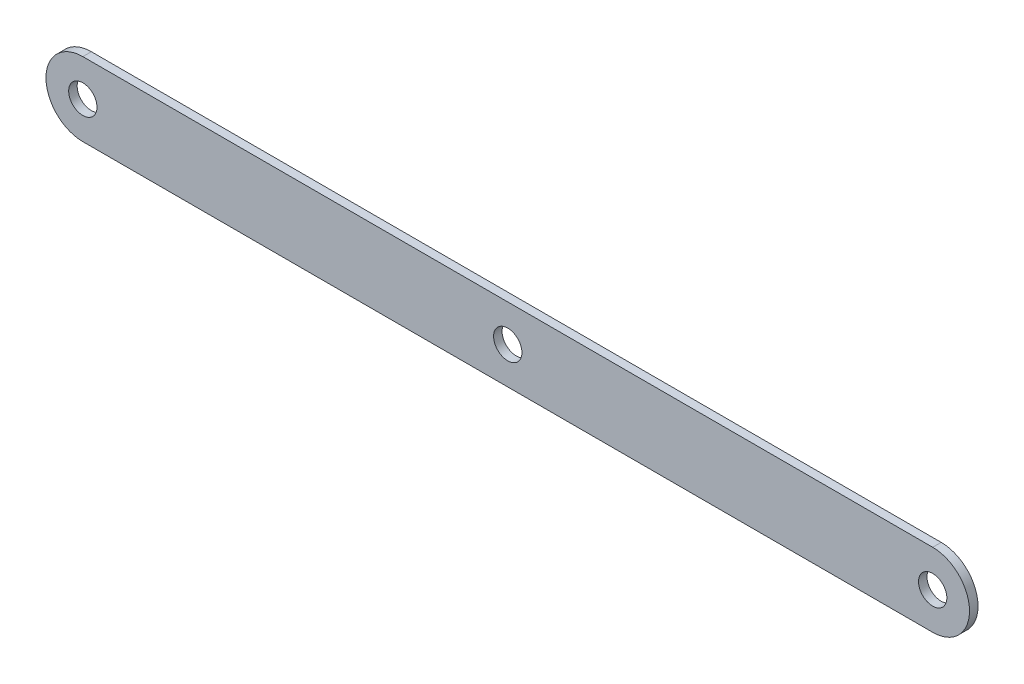
ISO-10303-21;
HEADER;
FILE_DESCRIPTION(('STEP AP214'),'2;1');
FILE_NAME('part.step','',(''),(''),'','','');
FILE_SCHEMA(('AUTOMOTIVE_DESIGN { 1 0 10303 214 1 1 1 1 }'));
ENDSEC;
DATA;
#1=APPLICATION_CONTEXT('core data for automotive mechanical design processes');
#2=APPLICATION_PROTOCOL_DEFINITION('international standard','automotive_design',2000,#1);
#3=PRODUCT_CONTEXT('',#1,'mechanical');
#4=PRODUCT('Part','Part','',(#3));
#5=PRODUCT_RELATED_PRODUCT_CATEGORY('part','',(#4));
#6=PRODUCT_DEFINITION_FORMATION('','',#4);
#7=PRODUCT_DEFINITION_CONTEXT('part definition',#1,'design');
#8=PRODUCT_DEFINITION('design','',#6,#7);
#9=PRODUCT_DEFINITION_SHAPE('','',#8);
#10=(LENGTH_UNIT() NAMED_UNIT(*) SI_UNIT(.MILLI.,.METRE.));
#11=(NAMED_UNIT(*) PLANE_ANGLE_UNIT() SI_UNIT($,.RADIAN.));
#12=(NAMED_UNIT(*) SI_UNIT($,.STERADIAN.) SOLID_ANGLE_UNIT());
#13=UNCERTAINTY_MEASURE_WITH_UNIT(LENGTH_MEASURE(1.E-05),#10,'distance_accuracy_value','');
#14=(GEOMETRIC_REPRESENTATION_CONTEXT(3) GLOBAL_UNCERTAINTY_ASSIGNED_CONTEXT((#13)) GLOBAL_UNIT_ASSIGNED_CONTEXT((#10,
#11,#12)) REPRESENTATION_CONTEXT('',''));
#15=CARTESIAN_POINT('',(0.,0.,0.));
#16=DIRECTION('',(0.,0.,1.));
#17=DIRECTION('',(1.,0.,0.));
#18=AXIS2_PLACEMENT_3D('',#15,#16,#17);
#19=CARTESIAN_POINT('',(-66.9426821064752,-6.26512341719928,1.5));
#20=DIRECTION('',(0.,0.,1.));
#21=DIRECTION('',(1.,0.,0.));
#22=AXIS2_PLACEMENT_3D('',#19,#20,#21);
#23=PLANE('',#22);
#24=CARTESIAN_POINT('',(83.0573178935247,-6.26512341719928,1.5));
#25=DIRECTION('',(0.,0.,1.));
#26=DIRECTION('',(1.,0.,0.));
#27=AXIS2_PLACEMENT_3D('',#24,#25,#26);
#28=CIRCLE('',#27,2.49999999999999);
#29=CARTESIAN_POINT('',(85.5573178935247,-6.26512341719928,1.5));
#30=VERTEX_POINT('',#29);
#31=EDGE_CURVE('E114',#30,#30,#28,.T.);
#32=ORIENTED_EDGE('',*,*,#31,.F.);
#33=EDGE_LOOP('',(#32));
#34=FACE_BOUND('',#33,.T.);
#35=CARTESIAN_POINT('',(-66.9426821064752,-6.26512341719928,1.5));
#36=DIRECTION('',(0.,0.,1.));
#37=DIRECTION('',(1.,0.,0.));
#38=AXIS2_PLACEMENT_3D('',#35,#36,#37);
#39=CIRCLE('',#38,6.5);
#40=CARTESIAN_POINT('',(-66.9426821064752,0.234876582800721,1.5));
#41=VERTEX_POINT('',#40);
#42=CARTESIAN_POINT('',(-66.9426821064752,-12.7651234171993,1.5));
#43=VERTEX_POINT('',#42);
#44=EDGE_CURVE('E84',#41,#43,#39,.T.);
#45=ORIENTED_EDGE('',*,*,#44,.T.);
#46=DIRECTION('',(1.,0.,0.));
#47=VECTOR('',#46,1.);
#48=CARTESIAN_POINT('',(-66.9426821064752,-12.7651234171993,1.5));
#49=LINE('',#48,#47);
#50=CARTESIAN_POINT('',(83.0573178935247,-12.7651234171993,1.5));
#51=VERTEX_POINT('',#50);
#52=EDGE_CURVE('E79',#43,#51,#49,.T.);
#53=ORIENTED_EDGE('',*,*,#52,.T.);
#54=CARTESIAN_POINT('',(83.0573178935247,-6.26512341719928,1.5));
#55=DIRECTION('',(0.,0.,1.));
#56=DIRECTION('',(-1.,0.,0.));
#57=AXIS2_PLACEMENT_3D('',#54,#55,#56);
#58=CIRCLE('',#57,6.5);
#59=CARTESIAN_POINT('',(83.0573178935247,0.234876582800721,1.5));
#60=VERTEX_POINT('',#59);
#61=EDGE_CURVE('E82',#51,#60,#58,.T.);
#62=ORIENTED_EDGE('',*,*,#61,.T.);
#63=DIRECTION('',(-1.,0.,0.));
#64=VECTOR('',#63,1.);
#65=CARTESIAN_POINT('',(-66.9426821064752,0.234876582800721,1.5));
#66=LINE('',#65,#64);
#67=EDGE_CURVE('E49',#60,#41,#66,.T.);
#68=ORIENTED_EDGE('',*,*,#67,.T.);
#69=EDGE_LOOP('',(#45,#53,#62,#68));
#70=FACE_BOUND('',#69,.T.);
#71=CARTESIAN_POINT('',(-66.9426821064752,-6.26512341719928,1.5));
#72=DIRECTION('',(0.,0.,1.));
#73=DIRECTION('',(1.,0.,0.));
#74=AXIS2_PLACEMENT_3D('',#71,#72,#73);
#75=CIRCLE('',#74,2.5);
#76=CARTESIAN_POINT('',(-64.4426821064752,-6.26512341719928,1.5));
#77=VERTEX_POINT('',#76);
#78=EDGE_CURVE('E99',#77,#77,#75,.T.);
#79=ORIENTED_EDGE('',*,*,#78,.F.);
#80=EDGE_LOOP('',(#79));
#81=FACE_BOUND('',#80,.T.);
#82=CARTESIAN_POINT('',(8.05731789352475,-6.26512341719928,1.5));
#83=DIRECTION('',(0.,0.,1.));
#84=DIRECTION('',(1.,0.,0.));
#85=AXIS2_PLACEMENT_3D('',#82,#83,#84);
#86=CIRCLE('',#85,2.5);
#87=CARTESIAN_POINT('',(10.5573178935247,-6.26512341719928,1.5));
#88=VERTEX_POINT('',#87);
#89=EDGE_CURVE('E120',#88,#88,#86,.T.);
#90=ORIENTED_EDGE('',*,*,#89,.F.);
#91=EDGE_LOOP('',(#90));
#92=FACE_BOUND('',#91,.T.);
#93=ADVANCED_FACE('F32',(#34,#70,#81,#92),#23,.T.);
#94=CARTESIAN_POINT('',(-66.9426821064752,-6.26512341719928,0.));
#95=DIRECTION('',(0.,0.,1.));
#96=DIRECTION('',(1.,0.,0.));
#97=AXIS2_PLACEMENT_3D('',#94,#95,#96);
#98=PLANE('',#97);
#99=CARTESIAN_POINT('',(83.0573178935247,-6.26512341719928,0.));
#100=DIRECTION('',(0.,0.,1.));
#101=DIRECTION('',(1.,0.,0.));
#102=AXIS2_PLACEMENT_3D('',#99,#100,#101);
#103=CIRCLE('',#102,2.49999999999999);
#104=CARTESIAN_POINT('',(85.5573178935247,-6.26512341719928,0.));
#105=VERTEX_POINT('',#104);
#106=EDGE_CURVE('E117',#105,#105,#103,.T.);
#107=ORIENTED_EDGE('',*,*,#106,.T.);
#108=EDGE_LOOP('',(#107));
#109=FACE_BOUND('',#108,.T.);
#110=CARTESIAN_POINT('',(-66.9426821064752,-6.26512341719928,0.));
#111=DIRECTION('',(0.,0.,1.));
#112=DIRECTION('',(1.,0.,0.));
#113=AXIS2_PLACEMENT_3D('',#110,#111,#112);
#114=CIRCLE('',#113,6.5);
#115=CARTESIAN_POINT('',(-66.9426821064752,0.234876582800721,0.));
#116=VERTEX_POINT('',#115);
#117=CARTESIAN_POINT('',(-66.9426821064752,-12.7651234171993,0.));
#118=VERTEX_POINT('',#117);
#119=EDGE_CURVE('E96',#116,#118,#114,.T.);
#120=ORIENTED_EDGE('',*,*,#119,.F.);
#121=DIRECTION('',(-1.,0.,0.));
#122=VECTOR('',#121,1.);
#123=CARTESIAN_POINT('',(-66.9426821064752,0.234876582800721,0.));
#124=LINE('',#123,#122);
#125=CARTESIAN_POINT('',(83.0573178935247,0.234876582800721,0.));
#126=VERTEX_POINT('',#125);
#127=EDGE_CURVE('E72',#126,#116,#124,.T.);
#128=ORIENTED_EDGE('',*,*,#127,.F.);
#129=CARTESIAN_POINT('',(83.0573178935247,-6.26512341719928,0.));
#130=DIRECTION('',(0.,0.,1.));
#131=DIRECTION('',(-1.,0.,0.));
#132=AXIS2_PLACEMENT_3D('',#129,#130,#131);
#133=CIRCLE('',#132,6.5);
#134=CARTESIAN_POINT('',(83.0573178935247,-12.7651234171993,0.));
#135=VERTEX_POINT('',#134);
#136=EDGE_CURVE('E66',#135,#126,#133,.T.);
#137=ORIENTED_EDGE('',*,*,#136,.F.);
#138=DIRECTION('',(1.,0.,0.));
#139=VECTOR('',#138,1.);
#140=CARTESIAN_POINT('',(-66.9426821064752,-12.7651234171993,0.));
#141=LINE('',#140,#139);
#142=EDGE_CURVE('E88',#118,#135,#141,.T.);
#143=ORIENTED_EDGE('',*,*,#142,.F.);
#144=EDGE_LOOP('',(#120,#128,#137,#143));
#145=FACE_BOUND('',#144,.T.);
#146=CARTESIAN_POINT('',(-66.9426821064752,-6.26512341719928,0.));
#147=DIRECTION('',(0.,0.,1.));
#148=DIRECTION('',(1.,0.,0.));
#149=AXIS2_PLACEMENT_3D('',#146,#147,#148);
#150=CIRCLE('',#149,2.5);
#151=CARTESIAN_POINT('',(-64.4426821064752,-6.26512341719928,0.));
#152=VERTEX_POINT('',#151);
#153=EDGE_CURVE('E111',#152,#152,#150,.T.);
#154=ORIENTED_EDGE('',*,*,#153,.T.);
#155=EDGE_LOOP('',(#154));
#156=FACE_BOUND('',#155,.T.);
#157=CARTESIAN_POINT('',(8.05731789352475,-6.26512341719928,0.));
#158=DIRECTION('',(0.,0.,1.));
#159=DIRECTION('',(1.,0.,0.));
#160=AXIS2_PLACEMENT_3D('',#157,#158,#159);
#161=CIRCLE('',#160,2.5);
#162=CARTESIAN_POINT('',(10.5573178935247,-6.26512341719928,0.));
#163=VERTEX_POINT('',#162);
#164=EDGE_CURVE('E123',#163,#163,#161,.T.);
#165=ORIENTED_EDGE('',*,*,#164,.T.);
#166=EDGE_LOOP('',(#165));
#167=FACE_BOUND('',#166,.T.);
#168=ADVANCED_FACE('F107',(#109,#145,#156,#167),#98,.F.);
#169=CARTESIAN_POINT('',(-66.9426821064752,-6.26512341719928,1.5));
#170=DIRECTION('',(0.,0.,-1.));
#171=DIRECTION('',(-1.,0.,0.));
#172=AXIS2_PLACEMENT_3D('',#169,#170,#171);
#173=CYLINDRICAL_SURFACE('',#172,6.5);
#174=ORIENTED_EDGE('',*,*,#119,.T.);
#175=DIRECTION('',(0.,0.,-1.));
#176=VECTOR('',#175,1.);
#177=CARTESIAN_POINT('',(-66.9426821064752,-12.7651234171993,1.5));
#178=LINE('',#177,#176);
#179=EDGE_CURVE('E11',#43,#118,#178,.T.);
#180=ORIENTED_EDGE('',*,*,#179,.F.);
#181=ORIENTED_EDGE('',*,*,#44,.F.);
#182=DIRECTION('',(0.,0.,-1.));
#183=VECTOR('',#182,1.);
#184=CARTESIAN_POINT('',(-66.9426821064752,0.234876582800721,1.5));
#185=LINE('',#184,#183);
#186=EDGE_CURVE('E92',#41,#116,#185,.T.);
#187=ORIENTED_EDGE('',*,*,#186,.T.);
#188=EDGE_LOOP('',(#174,#180,#181,#187));
#189=FACE_BOUND('',#188,.T.);
#190=ADVANCED_FACE('F34',(#189),#173,.T.);
#191=CARTESIAN_POINT('',(-66.9426821064752,-12.7651234171993,1.5));
#192=DIRECTION('',(0.,1.,0.));
#193=DIRECTION('',(0.,0.,1.));
#194=AXIS2_PLACEMENT_3D('',#191,#192,#193);
#195=PLANE('',#194);
#196=ORIENTED_EDGE('',*,*,#142,.T.);
#197=DIRECTION('',(0.,0.,-1.));
#198=VECTOR('',#197,1.);
#199=CARTESIAN_POINT('',(83.0573178935247,-12.7651234171993,1.5));
#200=LINE('',#199,#198);
#201=EDGE_CURVE('E41',#51,#135,#200,.T.);
#202=ORIENTED_EDGE('',*,*,#201,.F.);
#203=ORIENTED_EDGE('',*,*,#52,.F.);
#204=ORIENTED_EDGE('',*,*,#179,.T.);
#205=EDGE_LOOP('',(#196,#202,#203,#204));
#206=FACE_BOUND('',#205,.T.);
#207=ADVANCED_FACE('F87',(#206),#195,.F.);
#208=CARTESIAN_POINT('',(83.0573178935247,-6.26512341719928,1.5));
#209=DIRECTION('',(0.,0.,-1.));
#210=DIRECTION('',(-1.,0.,0.));
#211=AXIS2_PLACEMENT_3D('',#208,#209,#210);
#212=CYLINDRICAL_SURFACE('',#211,6.5);
#213=ORIENTED_EDGE('',*,*,#136,.T.);
#214=DIRECTION('',(0.,0.,-1.));
#215=VECTOR('',#214,1.);
#216=CARTESIAN_POINT('',(83.0573178935247,0.234876582800721,1.5));
#217=LINE('',#216,#215);
#218=EDGE_CURVE('E89',#60,#126,#217,.T.);
#219=ORIENTED_EDGE('',*,*,#218,.F.);
#220=ORIENTED_EDGE('',*,*,#61,.F.);
#221=ORIENTED_EDGE('',*,*,#201,.T.);
#222=EDGE_LOOP('',(#213,#219,#220,#221));
#223=FACE_BOUND('',#222,.T.);
#224=ADVANCED_FACE('F90',(#223),#212,.T.);
#225=CARTESIAN_POINT('',(-66.9426821064752,0.234876582800721,1.5));
#226=DIRECTION('',(0.,-1.,0.));
#227=DIRECTION('',(0.,0.,-1.));
#228=AXIS2_PLACEMENT_3D('',#225,#226,#227);
#229=PLANE('',#228);
#230=ORIENTED_EDGE('',*,*,#127,.T.);
#231=ORIENTED_EDGE('',*,*,#186,.F.);
#232=ORIENTED_EDGE('',*,*,#67,.F.);
#233=ORIENTED_EDGE('',*,*,#218,.T.);
#234=EDGE_LOOP('',(#230,#231,#232,#233));
#235=FACE_BOUND('',#234,.T.);
#236=ADVANCED_FACE('F104',(#235),#229,.F.);
#237=CARTESIAN_POINT('',(-66.9426821064752,-6.26512341719928,1.5));
#238=DIRECTION('',(0.,0.,-1.));
#239=DIRECTION('',(-1.,0.,0.));
#240=AXIS2_PLACEMENT_3D('',#237,#238,#239);
#241=CYLINDRICAL_SURFACE('',#240,2.5);
#242=ORIENTED_EDGE('',*,*,#78,.T.);
#243=EDGE_LOOP('',(#242));
#244=FACE_BOUND('',#243,.T.);
#245=ORIENTED_EDGE('',*,*,#153,.F.);
#246=EDGE_LOOP('',(#245));
#247=FACE_BOUND('',#246,.T.);
#248=ADVANCED_FACE('F142',(#244,#247),#241,.F.);
#249=CARTESIAN_POINT('',(83.0573178935247,-6.26512341719928,1.5));
#250=DIRECTION('',(0.,0.,-1.));
#251=DIRECTION('',(-1.,0.,0.));
#252=AXIS2_PLACEMENT_3D('',#249,#250,#251);
#253=CYLINDRICAL_SURFACE('',#252,2.49999999999999);
#254=ORIENTED_EDGE('',*,*,#31,.T.);
#255=EDGE_LOOP('',(#254));
#256=FACE_BOUND('',#255,.T.);
#257=ORIENTED_EDGE('',*,*,#106,.F.);
#258=EDGE_LOOP('',(#257));
#259=FACE_BOUND('',#258,.T.);
#260=ADVANCED_FACE('F188',(#256,#259),#253,.F.);
#261=CARTESIAN_POINT('',(8.05731789352475,-6.26512341719928,1.5));
#262=DIRECTION('',(0.,0.,-1.));
#263=DIRECTION('',(-1.,0.,0.));
#264=AXIS2_PLACEMENT_3D('',#261,#262,#263);
#265=CYLINDRICAL_SURFACE('',#264,2.5);
#266=ORIENTED_EDGE('',*,*,#89,.T.);
#267=EDGE_LOOP('',(#266));
#268=FACE_BOUND('',#267,.T.);
#269=ORIENTED_EDGE('',*,*,#164,.F.);
#270=EDGE_LOOP('',(#269));
#271=FACE_BOUND('',#270,.T.);
#272=ADVANCED_FACE('F129',(#268,#271),#265,.F.);
#273=CLOSED_SHELL('',(#93,#168,#190,#207,#224,#236,#248,#260,#272));
#274=MANIFOLD_SOLID_BREP('B2',#273);
#275=ADVANCED_BREP_SHAPE_REPRESENTATION('',(#18,#274),#14);
#276=SHAPE_DEFINITION_REPRESENTATION(#9,#275);
ENDSEC;
END-ISO-10303-21;
